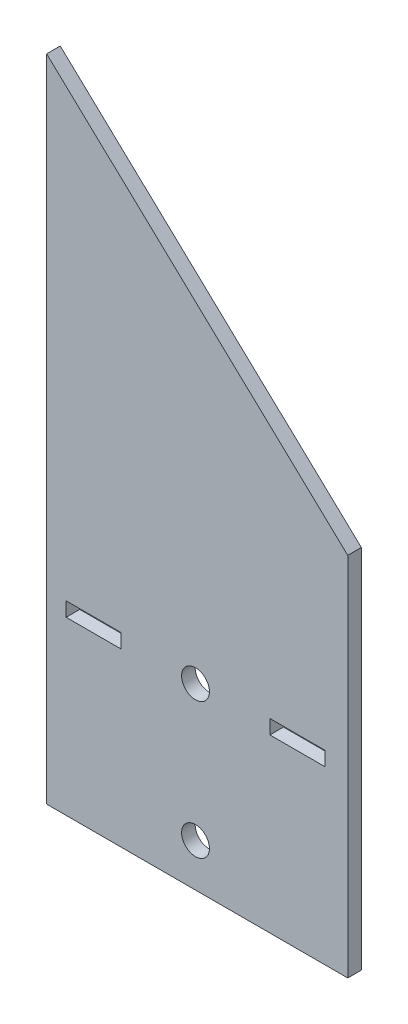
ISO-10303-21;
HEADER;
FILE_DESCRIPTION(('STEP AP214'),'2;1');
FILE_NAME('part.step','',(''),(''),'','','');
FILE_SCHEMA(('AUTOMOTIVE_DESIGN { 1 0 10303 214 1 1 1 1 }'));
ENDSEC;
DATA;
#1=APPLICATION_CONTEXT('core data for automotive mechanical design processes');
#2=APPLICATION_PROTOCOL_DEFINITION('international standard','automotive_design',2000,#1);
#3=PRODUCT_CONTEXT('',#1,'mechanical');
#4=PRODUCT('Part','Part','',(#3));
#5=PRODUCT_RELATED_PRODUCT_CATEGORY('part','',(#4));
#6=PRODUCT_DEFINITION_FORMATION('','',#4);
#7=PRODUCT_DEFINITION_CONTEXT('part definition',#1,'design');
#8=PRODUCT_DEFINITION('design','',#6,#7);
#9=PRODUCT_DEFINITION_SHAPE('','',#8);
#10=(LENGTH_UNIT() NAMED_UNIT(*) SI_UNIT(.MILLI.,.METRE.));
#11=(NAMED_UNIT(*) PLANE_ANGLE_UNIT() SI_UNIT($,.RADIAN.));
#12=(NAMED_UNIT(*) SI_UNIT($,.STERADIAN.) SOLID_ANGLE_UNIT());
#13=UNCERTAINTY_MEASURE_WITH_UNIT(LENGTH_MEASURE(1.E-05),#10,'distance_accuracy_value','');
#14=(GEOMETRIC_REPRESENTATION_CONTEXT(3) GLOBAL_UNCERTAINTY_ASSIGNED_CONTEXT((#13)) GLOBAL_UNIT_ASSIGNED_CONTEXT((#10,
#11,#12)) REPRESENTATION_CONTEXT('',''));
#15=CARTESIAN_POINT('',(0.,0.,0.));
#16=DIRECTION('',(0.,0.,1.));
#17=DIRECTION('',(1.,0.,0.));
#18=AXIS2_PLACEMENT_3D('',#15,#16,#17);
#19=CARTESIAN_POINT('',(0.,0.,2.));
#20=DIRECTION('',(0.,0.,1.));
#21=DIRECTION('',(1.,0.,0.));
#22=AXIS2_PLACEMENT_3D('',#19,#20,#21);
#23=PLANE('',#22);
#24=CARTESIAN_POINT('',(0.,-35.4,2.));
#25=DIRECTION('',(0.,0.,1.));
#26=DIRECTION('',(1.,0.,0.));
#27=AXIS2_PLACEMENT_3D('',#24,#25,#26);
#28=CIRCLE('',#27,2.05);
#29=CARTESIAN_POINT('',(2.05,-35.4,2.));
#30=VERTEX_POINT('',#29);
#31=EDGE_CURVE('E228',#30,#30,#28,.T.);
#32=ORIENTED_EDGE('',*,*,#31,.F.);
#33=EDGE_LOOP('',(#32));
#34=FACE_BOUND('',#33,.T.);
#35=DIRECTION('',(0.,-1.,0.));
#36=VECTOR('',#35,1.);
#37=CARTESIAN_POINT('',(-21.9186852395547,53.9686491456698,2.));
#38=LINE('',#37,#36);
#39=CARTESIAN_POINT('',(-21.9186852395547,53.9686491456698,2.));
#40=VERTEX_POINT('',#39);
#41=CARTESIAN_POINT('',(-21.9186852395547,-41.7145164843024,2.));
#42=VERTEX_POINT('',#41);
#43=EDGE_CURVE('E236',#40,#42,#38,.T.);
#44=ORIENTED_EDGE('',*,*,#43,.T.);
#45=DIRECTION('',(1.,0.,0.));
#46=VECTOR('',#45,1.);
#47=CARTESIAN_POINT('',(-21.9186852395547,-41.7145164843024,2.));
#48=LINE('',#47,#46);
#49=CARTESIAN_POINT('',(22.4194285012485,-41.7145164843024,2.));
#50=VERTEX_POINT('',#49);
#51=EDGE_CURVE('E239',#42,#50,#48,.T.);
#52=ORIENTED_EDGE('',*,*,#51,.T.);
#53=DIRECTION('',(0.,1.,0.));
#54=VECTOR('',#53,1.);
#55=CARTESIAN_POINT('',(22.4194285012485,-41.7145164843024,2.));
#56=LINE('',#55,#54);
#57=CARTESIAN_POINT('',(22.4194285012485,12.1880836962837,2.));
#58=VERTEX_POINT('',#57);
#59=EDGE_CURVE('E243',#50,#58,#56,.T.);
#60=ORIENTED_EDGE('',*,*,#59,.T.);
#61=DIRECTION('',(-0.727785532391963,0.685804796455192,0.));
#62=VECTOR('',#61,1.);
#63=CARTESIAN_POINT('',(22.4194285012485,12.1880836962837,2.));
#64=LINE('',#63,#62);
#65=EDGE_CURVE('E246',#58,#40,#64,.T.);
#66=ORIENTED_EDGE('',*,*,#65,.T.);
#67=EDGE_LOOP('',(#44,#52,#60,#66));
#68=FACE_BOUND('',#67,.T.);
#69=CARTESIAN_POINT('',(0.,-15.4,2.));
#70=DIRECTION('',(0.,0.,1.));
#71=DIRECTION('',(1.,0.,0.));
#72=AXIS2_PLACEMENT_3D('',#69,#70,#71);
#73=CIRCLE('',#72,2.05);
#74=CARTESIAN_POINT('',(2.05,-15.4,2.));
#75=VERTEX_POINT('',#74);
#76=EDGE_CURVE('E220',#75,#75,#73,.T.);
#77=ORIENTED_EDGE('',*,*,#76,.F.);
#78=EDGE_LOOP('',(#77));
#79=FACE_BOUND('',#78,.T.);
#80=DIRECTION('',(-1.,0.,0.));
#81=VECTOR('',#80,1.);
#82=CARTESIAN_POINT('',(-19.05,-14.35,2.));
#83=LINE('',#82,#81);
#84=CARTESIAN_POINT('',(-10.95,-14.35,2.));
#85=VERTEX_POINT('',#84);
#86=CARTESIAN_POINT('',(-19.05,-14.35,2.));
#87=VERTEX_POINT('',#86);
#88=EDGE_CURVE('E180',#85,#87,#83,.T.);
#89=ORIENTED_EDGE('',*,*,#88,.F.);
#90=DIRECTION('',(0.,1.,0.));
#91=VECTOR('',#90,1.);
#92=CARTESIAN_POINT('',(-10.95,-14.35,2.));
#93=LINE('',#92,#91);
#94=CARTESIAN_POINT('',(-10.95,-16.45,2.));
#95=VERTEX_POINT('',#94);
#96=EDGE_CURVE('E177',#95,#85,#93,.T.);
#97=ORIENTED_EDGE('',*,*,#96,.F.);
#98=DIRECTION('',(1.,0.,0.));
#99=VECTOR('',#98,1.);
#100=CARTESIAN_POINT('',(-19.05,-16.45,2.));
#101=LINE('',#100,#99);
#102=CARTESIAN_POINT('',(-19.05,-16.45,2.));
#103=VERTEX_POINT('',#102);
#104=EDGE_CURVE('E188',#103,#95,#101,.T.);
#105=ORIENTED_EDGE('',*,*,#104,.F.);
#106=DIRECTION('',(0.,-1.,0.));
#107=VECTOR('',#106,1.);
#108=CARTESIAN_POINT('',(-19.05,-14.35,2.));
#109=LINE('',#108,#107);
#110=EDGE_CURVE('E184',#87,#103,#109,.T.);
#111=ORIENTED_EDGE('',*,*,#110,.F.);
#112=EDGE_LOOP('',(#89,#97,#105,#111));
#113=FACE_BOUND('',#112,.T.);
#114=DIRECTION('',(0.,-1.,0.));
#115=VECTOR('',#114,1.);
#116=CARTESIAN_POINT('',(10.95,-14.35,2.));
#117=LINE('',#116,#115);
#118=CARTESIAN_POINT('',(10.95,-14.35,2.));
#119=VERTEX_POINT('',#118);
#120=CARTESIAN_POINT('',(10.95,-16.45,2.));
#121=VERTEX_POINT('',#120);
#122=EDGE_CURVE('E138',#119,#121,#117,.T.);
#123=ORIENTED_EDGE('',*,*,#122,.F.);
#124=DIRECTION('',(-1.,0.,0.));
#125=VECTOR('',#124,1.);
#126=CARTESIAN_POINT('',(19.05,-14.35,2.));
#127=LINE('',#126,#125);
#128=CARTESIAN_POINT('',(19.05,-14.35,2.));
#129=VERTEX_POINT('',#128);
#130=EDGE_CURVE('E129',#129,#119,#127,.T.);
#131=ORIENTED_EDGE('',*,*,#130,.F.);
#132=DIRECTION('',(0.,1.,0.));
#133=VECTOR('',#132,1.);
#134=CARTESIAN_POINT('',(19.05,-14.35,2.));
#135=LINE('',#134,#133);
#136=CARTESIAN_POINT('',(19.05,-16.45,2.));
#137=VERTEX_POINT('',#136);
#138=EDGE_CURVE('E155',#137,#129,#135,.T.);
#139=ORIENTED_EDGE('',*,*,#138,.F.);
#140=DIRECTION('',(1.,0.,0.));
#141=VECTOR('',#140,1.);
#142=CARTESIAN_POINT('',(19.05,-16.45,2.));
#143=LINE('',#142,#141);
#144=EDGE_CURVE('E151',#121,#137,#143,.T.);
#145=ORIENTED_EDGE('',*,*,#144,.F.);
#146=EDGE_LOOP('',(#123,#131,#139,#145));
#147=FACE_BOUND('',#146,.T.);
#148=ADVANCED_FACE('F39',(#34,#68,#79,#113,#147),#23,.T.);
#149=CARTESIAN_POINT('',(0.,0.,0.));
#150=DIRECTION('',(0.,0.,1.));
#151=DIRECTION('',(1.,0.,0.));
#152=AXIS2_PLACEMENT_3D('',#149,#150,#151);
#153=PLANE('',#152);
#154=DIRECTION('',(0.,1.,0.));
#155=VECTOR('',#154,1.);
#156=CARTESIAN_POINT('',(-10.95,-14.35,0.));
#157=LINE('',#156,#155);
#158=CARTESIAN_POINT('',(-10.95,-16.45,0.));
#159=VERTEX_POINT('',#158);
#160=CARTESIAN_POINT('',(-10.95,-14.35,0.));
#161=VERTEX_POINT('',#160);
#162=EDGE_CURVE('E147',#159,#161,#157,.T.);
#163=ORIENTED_EDGE('',*,*,#162,.T.);
#164=DIRECTION('',(-1.,0.,0.));
#165=VECTOR('',#164,1.);
#166=CARTESIAN_POINT('',(-19.05,-14.35,0.));
#167=LINE('',#166,#165);
#168=CARTESIAN_POINT('',(-19.05,-14.35,0.));
#169=VERTEX_POINT('',#168);
#170=EDGE_CURVE('E195',#161,#169,#167,.T.);
#171=ORIENTED_EDGE('',*,*,#170,.T.);
#172=DIRECTION('',(0.,-1.,0.));
#173=VECTOR('',#172,1.);
#174=CARTESIAN_POINT('',(-19.05,-14.35,0.));
#175=LINE('',#174,#173);
#176=CARTESIAN_POINT('',(-19.05,-16.45,0.));
#177=VERTEX_POINT('',#176);
#178=EDGE_CURVE('E199',#169,#177,#175,.T.);
#179=ORIENTED_EDGE('',*,*,#178,.T.);
#180=DIRECTION('',(1.,0.,0.));
#181=VECTOR('',#180,1.);
#182=CARTESIAN_POINT('',(-19.05,-16.45,0.));
#183=LINE('',#182,#181);
#184=EDGE_CURVE('E181',#177,#159,#183,.T.);
#185=ORIENTED_EDGE('',*,*,#184,.T.);
#186=EDGE_LOOP('',(#163,#171,#179,#185));
#187=FACE_BOUND('',#186,.T.);
#188=DIRECTION('',(0.,-1.,0.));
#189=VECTOR('',#188,1.);
#190=CARTESIAN_POINT('',(-21.9186852395547,-9.78780843153248,0.));
#191=LINE('',#190,#189);
#192=CARTESIAN_POINT('',(-21.9186852395547,53.9686491456698,0.));
#193=VERTEX_POINT('',#192);
#194=CARTESIAN_POINT('',(-21.9186852395547,-41.7145164843024,0.));
#195=VERTEX_POINT('',#194);
#196=EDGE_CURVE('E232',#193,#195,#191,.T.);
#197=ORIENTED_EDGE('',*,*,#196,.F.);
#198=DIRECTION('',(-0.727785532391963,0.685804796455192,0.));
#199=VECTOR('',#198,1.);
#200=CARTESIAN_POINT('',(22.4194285012485,12.1880836962837,0.));
#201=LINE('',#200,#199);
#202=CARTESIAN_POINT('',(22.4194285012485,12.1880836962837,0.));
#203=VERTEX_POINT('',#202);
#204=EDGE_CURVE('E240',#203,#193,#201,.T.);
#205=ORIENTED_EDGE('',*,*,#204,.F.);
#206=DIRECTION('',(0.,1.,0.));
#207=VECTOR('',#206,1.);
#208=CARTESIAN_POINT('',(22.4194285012485,-9.78780843153248,0.));
#209=LINE('',#208,#207);
#210=CARTESIAN_POINT('',(22.4194285012485,-41.7145164843024,0.));
#211=VERTEX_POINT('',#210);
#212=EDGE_CURVE('E256',#211,#203,#209,.T.);
#213=ORIENTED_EDGE('',*,*,#212,.F.);
#214=DIRECTION('',(1.,0.,0.));
#215=VECTOR('',#214,1.);
#216=CARTESIAN_POINT('',(-21.9186852395547,-41.7145164843024,0.));
#217=LINE('',#216,#215);
#218=EDGE_CURVE('E252',#195,#211,#217,.T.);
#219=ORIENTED_EDGE('',*,*,#218,.F.);
#220=EDGE_LOOP('',(#197,#205,#213,#219));
#221=FACE_BOUND('',#220,.T.);
#222=CARTESIAN_POINT('',(0.,-35.4,0.));
#223=DIRECTION('',(0.,0.,1.));
#224=DIRECTION('',(1.,0.,0.));
#225=AXIS2_PLACEMENT_3D('',#222,#223,#224);
#226=CIRCLE('',#225,2.05);
#227=CARTESIAN_POINT('',(2.05,-35.4,0.));
#228=VERTEX_POINT('',#227);
#229=EDGE_CURVE('E224',#228,#228,#226,.T.);
#230=ORIENTED_EDGE('',*,*,#229,.T.);
#231=EDGE_LOOP('',(#230));
#232=FACE_BOUND('',#231,.T.);
#233=CARTESIAN_POINT('',(0.,-15.4,0.));
#234=DIRECTION('',(0.,0.,1.));
#235=DIRECTION('',(1.,0.,0.));
#236=AXIS2_PLACEMENT_3D('',#233,#234,#235);
#237=CIRCLE('',#236,2.05);
#238=CARTESIAN_POINT('',(2.05,-15.4,0.));
#239=VERTEX_POINT('',#238);
#240=EDGE_CURVE('E219',#239,#239,#237,.T.);
#241=ORIENTED_EDGE('',*,*,#240,.T.);
#242=EDGE_LOOP('',(#241));
#243=FACE_BOUND('',#242,.T.);
#244=DIRECTION('',(-1.,0.,0.));
#245=VECTOR('',#244,1.);
#246=CARTESIAN_POINT('',(19.05,-14.35,0.));
#247=LINE('',#246,#245);
#248=CARTESIAN_POINT('',(19.05,-14.35,0.));
#249=VERTEX_POINT('',#248);
#250=CARTESIAN_POINT('',(10.95,-14.35,0.));
#251=VERTEX_POINT('',#250);
#252=EDGE_CURVE('E63',#249,#251,#247,.T.);
#253=ORIENTED_EDGE('',*,*,#252,.T.);
#254=DIRECTION('',(0.,-1.,0.));
#255=VECTOR('',#254,1.);
#256=CARTESIAN_POINT('',(10.95,-14.35,0.));
#257=LINE('',#256,#255);
#258=CARTESIAN_POINT('',(10.95,-16.45,0.));
#259=VERTEX_POINT('',#258);
#260=EDGE_CURVE('E145',#251,#259,#257,.T.);
#261=ORIENTED_EDGE('',*,*,#260,.T.);
#262=DIRECTION('',(1.,0.,0.));
#263=VECTOR('',#262,1.);
#264=CARTESIAN_POINT('',(19.05,-16.45,0.));
#265=LINE('',#264,#263);
#266=CARTESIAN_POINT('',(19.05,-16.45,0.));
#267=VERTEX_POINT('',#266);
#268=EDGE_CURVE('E164',#259,#267,#265,.T.);
#269=ORIENTED_EDGE('',*,*,#268,.T.);
#270=DIRECTION('',(0.,1.,0.));
#271=VECTOR('',#270,1.);
#272=CARTESIAN_POINT('',(19.05,-14.35,0.));
#273=LINE('',#272,#271);
#274=EDGE_CURVE('E139',#267,#249,#273,.T.);
#275=ORIENTED_EDGE('',*,*,#274,.T.);
#276=EDGE_LOOP('',(#253,#261,#269,#275));
#277=FACE_BOUND('',#276,.T.);
#278=ADVANCED_FACE('F281',(#187,#221,#232,#243,#277),#153,.F.);
#279=CARTESIAN_POINT('',(-21.9186852395547,-9.78780843153248,2.));
#280=DIRECTION('',(1.,0.,0.));
#281=DIRECTION('',(0.,0.,-1.));
#282=AXIS2_PLACEMENT_3D('',#279,#280,#281);
#283=PLANE('',#282);
#284=ORIENTED_EDGE('',*,*,#196,.T.);
#285=DIRECTION('',(0.,0.,-1.));
#286=VECTOR('',#285,1.);
#287=CARTESIAN_POINT('',(-21.9186852395547,-41.7145164843024,2.));
#288=LINE('',#287,#286);
#289=EDGE_CURVE('E11',#42,#195,#288,.T.);
#290=ORIENTED_EDGE('',*,*,#289,.F.);
#291=ORIENTED_EDGE('',*,*,#43,.F.);
#292=DIRECTION('',(0.,0.,-1.));
#293=VECTOR('',#292,1.);
#294=CARTESIAN_POINT('',(-21.9186852395547,53.9686491456698,2.));
#295=LINE('',#294,#293);
#296=EDGE_CURVE('E249',#40,#193,#295,.T.);
#297=ORIENTED_EDGE('',*,*,#296,.T.);
#298=EDGE_LOOP('',(#284,#290,#291,#297));
#299=FACE_BOUND('',#298,.T.);
#300=ADVANCED_FACE('F41',(#299),#283,.F.);
#301=CARTESIAN_POINT('',(-21.9186852395547,-41.7145164843024,2.));
#302=DIRECTION('',(0.,1.,0.));
#303=DIRECTION('',(0.,0.,1.));
#304=AXIS2_PLACEMENT_3D('',#301,#302,#303);
#305=PLANE('',#304);
#306=ORIENTED_EDGE('',*,*,#218,.T.);
#307=DIRECTION('',(0.,0.,-1.));
#308=VECTOR('',#307,1.);
#309=CARTESIAN_POINT('',(22.4194285012485,-41.7145164843024,2.));
#310=LINE('',#309,#308);
#311=EDGE_CURVE('E48',#50,#211,#310,.T.);
#312=ORIENTED_EDGE('',*,*,#311,.F.);
#313=ORIENTED_EDGE('',*,*,#51,.F.);
#314=ORIENTED_EDGE('',*,*,#289,.T.);
#315=EDGE_LOOP('',(#306,#312,#313,#314));
#316=FACE_BOUND('',#315,.T.);
#317=ADVANCED_FACE('F277',(#316),#305,.F.);
#318=CARTESIAN_POINT('',(22.4194285012485,-9.78780843153248,2.));
#319=DIRECTION('',(-1.,0.,0.));
#320=DIRECTION('',(0.,0.,1.));
#321=AXIS2_PLACEMENT_3D('',#318,#319,#320);
#322=PLANE('',#321);
#323=ORIENTED_EDGE('',*,*,#212,.T.);
#324=DIRECTION('',(0.,0.,-1.));
#325=VECTOR('',#324,1.);
#326=CARTESIAN_POINT('',(22.4194285012485,12.1880836962837,2.));
#327=LINE('',#326,#325);
#328=EDGE_CURVE('E265',#58,#203,#327,.T.);
#329=ORIENTED_EDGE('',*,*,#328,.F.);
#330=ORIENTED_EDGE('',*,*,#59,.F.);
#331=ORIENTED_EDGE('',*,*,#311,.T.);
#332=EDGE_LOOP('',(#323,#329,#330,#331));
#333=FACE_BOUND('',#332,.T.);
#334=ADVANCED_FACE('F273',(#333),#322,.F.);
#335=CARTESIAN_POINT('',(22.4194285012485,12.1880836962837,2.));
#336=DIRECTION('',(-0.685804796455192,-0.727785532391963,0.));
#337=DIRECTION('',(0.727785532391963,-0.685804796455192,0.));
#338=AXIS2_PLACEMENT_3D('',#335,#336,#337);
#339=PLANE('',#338);
#340=ORIENTED_EDGE('',*,*,#204,.T.);
#341=ORIENTED_EDGE('',*,*,#296,.F.);
#342=ORIENTED_EDGE('',*,*,#65,.F.);
#343=ORIENTED_EDGE('',*,*,#328,.T.);
#344=EDGE_LOOP('',(#340,#341,#342,#343));
#345=FACE_BOUND('',#344,.T.);
#346=ADVANCED_FACE('F286',(#345),#339,.F.);
#347=CARTESIAN_POINT('',(0.,-35.4,2.));
#348=DIRECTION('',(0.,0.,-1.));
#349=DIRECTION('',(-1.,0.,0.));
#350=AXIS2_PLACEMENT_3D('',#347,#348,#349);
#351=CYLINDRICAL_SURFACE('',#350,2.05);
#352=ORIENTED_EDGE('',*,*,#31,.T.);
#353=EDGE_LOOP('',(#352));
#354=FACE_BOUND('',#353,.T.);
#355=ORIENTED_EDGE('',*,*,#229,.F.);
#356=EDGE_LOOP('',(#355));
#357=FACE_BOUND('',#356,.T.);
#358=ADVANCED_FACE('F332',(#354,#357),#351,.F.);
#359=CARTESIAN_POINT('',(0.,-15.4,2.));
#360=DIRECTION('',(0.,0.,-1.));
#361=DIRECTION('',(-1.,0.,0.));
#362=AXIS2_PLACEMENT_3D('',#359,#360,#361);
#363=CYLINDRICAL_SURFACE('',#362,2.05);
#364=ORIENTED_EDGE('',*,*,#76,.T.);
#365=EDGE_LOOP('',(#364));
#366=FACE_BOUND('',#365,.T.);
#367=ORIENTED_EDGE('',*,*,#240,.F.);
#368=EDGE_LOOP('',(#367));
#369=FACE_BOUND('',#368,.T.);
#370=ADVANCED_FACE('F329',(#366,#369),#363,.F.);
#371=CARTESIAN_POINT('',(-10.95,-14.35,2.));
#372=DIRECTION('',(-1.,0.,0.));
#373=DIRECTION('',(0.,0.,1.));
#374=AXIS2_PLACEMENT_3D('',#371,#372,#373);
#375=PLANE('',#374);
#376=ORIENTED_EDGE('',*,*,#162,.F.);
#377=DIRECTION('',(0.,0.,-1.));
#378=VECTOR('',#377,1.);
#379=CARTESIAN_POINT('',(-10.95,-16.45,2.));
#380=LINE('',#379,#378);
#381=EDGE_CURVE('E191',#95,#159,#380,.T.);
#382=ORIENTED_EDGE('',*,*,#381,.F.);
#383=ORIENTED_EDGE('',*,*,#96,.T.);
#384=DIRECTION('',(0.,0.,-1.));
#385=VECTOR('',#384,1.);
#386=CARTESIAN_POINT('',(-10.95,-14.35,2.));
#387=LINE('',#386,#385);
#388=EDGE_CURVE('E215',#85,#161,#387,.T.);
#389=ORIENTED_EDGE('',*,*,#388,.T.);
#390=EDGE_LOOP('',(#376,#382,#383,#389));
#391=FACE_BOUND('',#390,.T.);
#392=ADVANCED_FACE('F311',(#391),#375,.T.);
#393=CARTESIAN_POINT('',(-19.05,-14.35,2.));
#394=DIRECTION('',(0.,-1.,0.));
#395=DIRECTION('',(0.,0.,-1.));
#396=AXIS2_PLACEMENT_3D('',#393,#394,#395);
#397=PLANE('',#396);
#398=ORIENTED_EDGE('',*,*,#170,.F.);
#399=ORIENTED_EDGE('',*,*,#388,.F.);
#400=ORIENTED_EDGE('',*,*,#88,.T.);
#401=DIRECTION('',(0.,0.,-1.));
#402=VECTOR('',#401,1.);
#403=CARTESIAN_POINT('',(-19.05,-14.35,2.));
#404=LINE('',#403,#402);
#405=EDGE_CURVE('E212',#87,#169,#404,.T.);
#406=ORIENTED_EDGE('',*,*,#405,.T.);
#407=EDGE_LOOP('',(#398,#399,#400,#406));
#408=FACE_BOUND('',#407,.T.);
#409=ADVANCED_FACE('F304',(#408),#397,.T.);
#410=CARTESIAN_POINT('',(-19.05,-14.35,2.));
#411=DIRECTION('',(1.,0.,0.));
#412=DIRECTION('',(0.,0.,-1.));
#413=AXIS2_PLACEMENT_3D('',#410,#411,#412);
#414=PLANE('',#413);
#415=ORIENTED_EDGE('',*,*,#178,.F.);
#416=ORIENTED_EDGE('',*,*,#405,.F.);
#417=ORIENTED_EDGE('',*,*,#110,.T.);
#418=DIRECTION('',(0.,0.,-1.));
#419=VECTOR('',#418,1.);
#420=CARTESIAN_POINT('',(-19.05,-16.45,2.));
#421=LINE('',#420,#419);
#422=EDGE_CURVE('E209',#103,#177,#421,.T.);
#423=ORIENTED_EDGE('',*,*,#422,.T.);
#424=EDGE_LOOP('',(#415,#416,#417,#423));
#425=FACE_BOUND('',#424,.T.);
#426=ADVANCED_FACE('F307',(#425),#414,.T.);
#427=CARTESIAN_POINT('',(-19.05,-16.45,2.));
#428=DIRECTION('',(0.,1.,0.));
#429=DIRECTION('',(0.,0.,1.));
#430=AXIS2_PLACEMENT_3D('',#427,#428,#429);
#431=PLANE('',#430);
#432=ORIENTED_EDGE('',*,*,#184,.F.);
#433=ORIENTED_EDGE('',*,*,#422,.F.);
#434=ORIENTED_EDGE('',*,*,#104,.T.);
#435=ORIENTED_EDGE('',*,*,#381,.T.);
#436=EDGE_LOOP('',(#432,#433,#434,#435));
#437=FACE_BOUND('',#436,.T.);
#438=ADVANCED_FACE('F314',(#437),#431,.T.);
#439=CARTESIAN_POINT('',(19.05,-14.35,2.));
#440=DIRECTION('',(0.,-1.,0.));
#441=DIRECTION('',(0.,0.,-1.));
#442=AXIS2_PLACEMENT_3D('',#439,#440,#441);
#443=PLANE('',#442);
#444=ORIENTED_EDGE('',*,*,#252,.F.);
#445=DIRECTION('',(0.,0.,-1.));
#446=VECTOR('',#445,1.);
#447=CARTESIAN_POINT('',(19.05,-14.35,2.));
#448=LINE('',#447,#446);
#449=EDGE_CURVE('E133',#129,#249,#448,.T.);
#450=ORIENTED_EDGE('',*,*,#449,.F.);
#451=ORIENTED_EDGE('',*,*,#130,.T.);
#452=DIRECTION('',(0.,0.,-1.));
#453=VECTOR('',#452,1.);
#454=CARTESIAN_POINT('',(10.95,-14.35,2.));
#455=LINE('',#454,#453);
#456=EDGE_CURVE('E132',#119,#251,#455,.T.);
#457=ORIENTED_EDGE('',*,*,#456,.T.);
#458=EDGE_LOOP('',(#444,#450,#451,#457));
#459=FACE_BOUND('',#458,.T.);
#460=ADVANCED_FACE('F131',(#459),#443,.T.);
#461=CARTESIAN_POINT('',(10.95,-14.35,2.));
#462=DIRECTION('',(1.,0.,0.));
#463=DIRECTION('',(0.,0.,-1.));
#464=AXIS2_PLACEMENT_3D('',#461,#462,#463);
#465=PLANE('',#464);
#466=ORIENTED_EDGE('',*,*,#260,.F.);
#467=ORIENTED_EDGE('',*,*,#456,.F.);
#468=ORIENTED_EDGE('',*,*,#122,.T.);
#469=DIRECTION('',(0.,0.,-1.));
#470=VECTOR('',#469,1.);
#471=CARTESIAN_POINT('',(10.95,-16.45,2.));
#472=LINE('',#471,#470);
#473=EDGE_CURVE('E148',#121,#259,#472,.T.);
#474=ORIENTED_EDGE('',*,*,#473,.T.);
#475=EDGE_LOOP('',(#466,#467,#468,#474));
#476=FACE_BOUND('',#475,.T.);
#477=ADVANCED_FACE('F142',(#476),#465,.T.);
#478=CARTESIAN_POINT('',(19.05,-16.45,2.));
#479=DIRECTION('',(0.,1.,0.));
#480=DIRECTION('',(0.,0.,1.));
#481=AXIS2_PLACEMENT_3D('',#478,#479,#480);
#482=PLANE('',#481);
#483=ORIENTED_EDGE('',*,*,#268,.F.);
#484=ORIENTED_EDGE('',*,*,#473,.F.);
#485=ORIENTED_EDGE('',*,*,#144,.T.);
#486=DIRECTION('',(0.,0.,-1.));
#487=VECTOR('',#486,1.);
#488=CARTESIAN_POINT('',(19.05,-16.45,2.));
#489=LINE('',#488,#487);
#490=EDGE_CURVE('E55',#137,#267,#489,.T.);
#491=ORIENTED_EDGE('',*,*,#490,.T.);
#492=EDGE_LOOP('',(#483,#484,#485,#491));
#493=FACE_BOUND('',#492,.T.);
#494=ADVANCED_FACE('F424',(#493),#482,.T.);
#495=CARTESIAN_POINT('',(19.05,-14.35,2.));
#496=DIRECTION('',(-1.,0.,0.));
#497=DIRECTION('',(0.,0.,1.));
#498=AXIS2_PLACEMENT_3D('',#495,#496,#497);
#499=PLANE('',#498);
#500=ORIENTED_EDGE('',*,*,#274,.F.);
#501=ORIENTED_EDGE('',*,*,#490,.F.);
#502=ORIENTED_EDGE('',*,*,#138,.T.);
#503=ORIENTED_EDGE('',*,*,#449,.T.);
#504=EDGE_LOOP('',(#500,#501,#502,#503));
#505=FACE_BOUND('',#504,.T.);
#506=ADVANCED_FACE('F431',(#505),#499,.T.);
#507=CLOSED_SHELL('',(#148,#278,#300,#317,#334,#346,#358,#370,#392,#409,#426,#438,#460,#477,
#494,#506));
#508=MANIFOLD_SOLID_BREP('B2',#507);
#509=ADVANCED_BREP_SHAPE_REPRESENTATION('',(#18,#508),#14);
#510=SHAPE_DEFINITION_REPRESENTATION(#9,#509);
ENDSEC;
END-ISO-10303-21;
